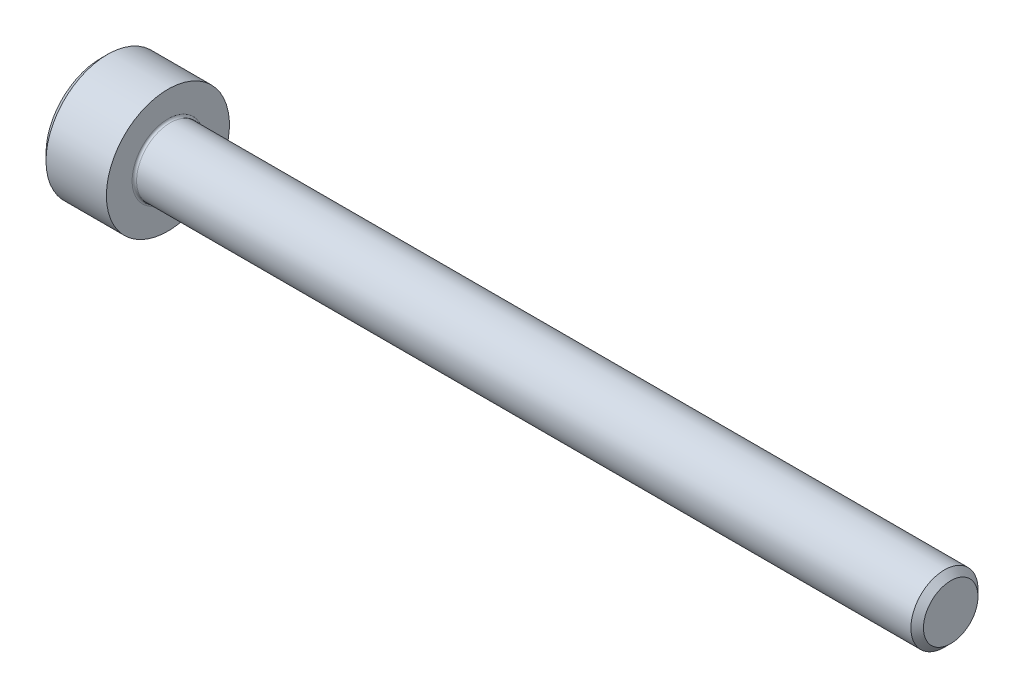
ISO-10303-21;
HEADER;
FILE_DESCRIPTION(('STEP AP214'),'2;1');
FILE_NAME('part.step','',(''),(''),'','','');
FILE_SCHEMA(('AUTOMOTIVE_DESIGN { 1 0 10303 214 1 1 1 1 }'));
ENDSEC;
DATA;
#1=APPLICATION_CONTEXT('core data for automotive mechanical design processes');
#2=APPLICATION_PROTOCOL_DEFINITION('international standard','automotive_design',2000,#1);
#3=PRODUCT_CONTEXT('',#1,'mechanical');
#4=PRODUCT('Part','Part','',(#3));
#5=PRODUCT_RELATED_PRODUCT_CATEGORY('part','',(#4));
#6=PRODUCT_DEFINITION_FORMATION('','',#4);
#7=PRODUCT_DEFINITION_CONTEXT('part definition',#1,'design');
#8=PRODUCT_DEFINITION('design','',#6,#7);
#9=PRODUCT_DEFINITION_SHAPE('','',#8);
#10=(LENGTH_UNIT() NAMED_UNIT(*) SI_UNIT(.MILLI.,.METRE.));
#11=(NAMED_UNIT(*) PLANE_ANGLE_UNIT() SI_UNIT($,.RADIAN.));
#12=(NAMED_UNIT(*) SI_UNIT($,.STERADIAN.) SOLID_ANGLE_UNIT());
#13=UNCERTAINTY_MEASURE_WITH_UNIT(LENGTH_MEASURE(1.E-05),#10,'distance_accuracy_value','');
#14=(GEOMETRIC_REPRESENTATION_CONTEXT(3) GLOBAL_UNCERTAINTY_ASSIGNED_CONTEXT((#13)) GLOBAL_UNIT_ASSIGNED_CONTEXT((#10,
#11,#12)) REPRESENTATION_CONTEXT('',''));
#15=CARTESIAN_POINT('',(0.,0.,0.));
#16=DIRECTION('',(0.,0.,1.));
#17=DIRECTION('',(1.,0.,0.));
#18=AXIS2_PLACEMENT_3D('',#15,#16,#17);
#19=CARTESIAN_POINT('',(0.,0.,0.));
#20=DIRECTION('',(-1.,0.,0.));
#21=DIRECTION('',(0.,0.,1.));
#22=AXIS2_PLACEMENT_3D('',#19,#20,#21);
#23=PLANE('',#22);
#24=DIRECTION('',(0.,-0.5,0.86602540378444));
#25=VECTOR('',#24,1.);
#26=CARTESIAN_POINT('',(0.,1.47801668912544,0.));
#27=LINE('',#26,#25);
#28=CARTESIAN_POINT('',(0.,1.47801668912544,0.));
#29=VERTEX_POINT('',#28);
#30=CARTESIAN_POINT('',(0.,0.739008344562719,1.28));
#31=VERTEX_POINT('',#30);
#32=EDGE_CURVE('E247',#29,#31,#27,.T.);
#33=ORIENTED_EDGE('',*,*,#32,.T.);
#34=DIRECTION('',(0.,1.,0.));
#35=VECTOR('',#34,1.);
#36=CARTESIAN_POINT('',(0.,-0.739008344562723,1.28));
#37=LINE('',#36,#35);
#38=CARTESIAN_POINT('',(0.,-0.739008344562723,1.28));
#39=VERTEX_POINT('',#38);
#40=EDGE_CURVE('E113',#39,#31,#37,.T.);
#41=ORIENTED_EDGE('',*,*,#40,.F.);
#42=DIRECTION('',(0.,-0.5,-0.866025403784438));
#43=VECTOR('',#42,1.);
#44=CARTESIAN_POINT('',(0.,-0.739008344562723,1.28));
#45=LINE('',#44,#43);
#46=CARTESIAN_POINT('',(0.,-1.47801668912545,0.));
#47=VERTEX_POINT('',#46);
#48=EDGE_CURVE('E250',#39,#47,#45,.T.);
#49=ORIENTED_EDGE('',*,*,#48,.T.);
#50=DIRECTION('',(0.,0.5,-0.866025403784439));
#51=VECTOR('',#50,1.);
#52=CARTESIAN_POINT('',(0.,-1.47801668912545,0.));
#53=LINE('',#52,#51);
#54=CARTESIAN_POINT('',(0.,-0.739008344562726,-1.28));
#55=VERTEX_POINT('',#54);
#56=EDGE_CURVE('E253',#47,#55,#53,.T.);
#57=ORIENTED_EDGE('',*,*,#56,.T.);
#58=DIRECTION('',(0.,-1.,0.));
#59=VECTOR('',#58,1.);
#60=CARTESIAN_POINT('',(0.,0.739008344562715,-1.28));
#61=LINE('',#60,#59);
#62=CARTESIAN_POINT('',(0.,0.739008344562715,-1.28));
#63=VERTEX_POINT('',#62);
#64=EDGE_CURVE('E256',#63,#55,#61,.T.);
#65=ORIENTED_EDGE('',*,*,#64,.F.);
#66=DIRECTION('',(0.,-0.5,-0.866025403784438));
#67=VECTOR('',#66,1.);
#68=CARTESIAN_POINT('',(0.,1.47801668912544,0.));
#69=LINE('',#68,#67);
#70=EDGE_CURVE('E108',#29,#63,#69,.T.);
#71=ORIENTED_EDGE('',*,*,#70,.F.);
#72=EDGE_LOOP('',(#33,#41,#49,#57,#65,#71));
#73=FACE_BOUND('',#72,.T.);
#74=CARTESIAN_POINT('',(0.,0.,0.));
#75=DIRECTION('',(-1.,0.,0.));
#76=DIRECTION('',(0.,0.,1.));
#77=AXIS2_PLACEMENT_3D('',#74,#75,#76);
#78=CIRCLE('',#77,2.45);
#79=CARTESIAN_POINT('',(0.,0.,2.45));
#80=VERTEX_POINT('',#79);
#81=EDGE_CURVE('E137',#80,#80,#78,.T.);
#82=ORIENTED_EDGE('',*,*,#81,.T.);
#83=EDGE_LOOP('',(#82));
#84=FACE_BOUND('',#83,.T.);
#85=ADVANCED_FACE('F17',(#73,#84),#23,.T.);
#86=CARTESIAN_POINT('',(0.,0.,0.));
#87=DIRECTION('',(1.,0.,0.));
#88=DIRECTION('',(0.,0.,-1.));
#89=AXIS2_PLACEMENT_3D('',#86,#87,#88);
#90=CONICAL_SURFACE('',#89,2.45,0.785398163397443);
#91=CARTESIAN_POINT('',(0.3,0.,0.));
#92=DIRECTION('',(-1.,0.,0.));
#93=DIRECTION('',(0.,0.,1.));
#94=AXIS2_PLACEMENT_3D('',#91,#92,#93);
#95=CIRCLE('',#94,2.75);
#96=CARTESIAN_POINT('',(0.3,0.,2.75));
#97=VERTEX_POINT('',#96);
#98=EDGE_CURVE('E134',#97,#97,#95,.T.);
#99=ORIENTED_EDGE('',*,*,#98,.T.);
#100=EDGE_LOOP('',(#99));
#101=FACE_BOUND('',#100,.T.);
#102=ORIENTED_EDGE('',*,*,#81,.F.);
#103=EDGE_LOOP('',(#102));
#104=FACE_BOUND('',#103,.T.);
#105=ADVANCED_FACE('F160',(#101,#104),#90,.T.);
#106=CARTESIAN_POINT('',(-31.75,0.,0.));
#107=DIRECTION('',(-1.,0.,0.));
#108=DIRECTION('',(0.,0.,1.));
#109=AXIS2_PLACEMENT_3D('',#106,#107,#108);
#110=CYLINDRICAL_SURFACE('',#109,2.75);
#111=CARTESIAN_POINT('',(3.,0.,0.));
#112=DIRECTION('',(-1.,0.,0.));
#113=DIRECTION('',(0.,0.,1.));
#114=AXIS2_PLACEMENT_3D('',#111,#112,#113);
#115=CIRCLE('',#114,2.75);
#116=CARTESIAN_POINT('',(3.,0.,2.75));
#117=VERTEX_POINT('',#116);
#118=EDGE_CURVE('E131',#117,#117,#115,.T.);
#119=ORIENTED_EDGE('',*,*,#118,.T.);
#120=EDGE_LOOP('',(#119));
#121=FACE_BOUND('',#120,.T.);
#122=ORIENTED_EDGE('',*,*,#98,.F.);
#123=EDGE_LOOP('',(#122));
#124=FACE_BOUND('',#123,.T.);
#125=ADVANCED_FACE('F166',(#121,#124),#110,.T.);
#126=CARTESIAN_POINT('',(3.,2.75,0.));
#127=DIRECTION('',(1.,0.,0.));
#128=DIRECTION('',(0.,0.,-1.));
#129=AXIS2_PLACEMENT_3D('',#126,#127,#128);
#130=PLANE('',#129);
#131=CARTESIAN_POINT('',(3.,0.,0.));
#132=DIRECTION('',(1.,0.,0.));
#133=DIRECTION('',(0.,0.,-1.));
#134=AXIS2_PLACEMENT_3D('',#131,#132,#133);
#135=CIRCLE('',#134,1.6);
#136=CARTESIAN_POINT('',(3.,0.,-1.6));
#137=VERTEX_POINT('',#136);
#138=EDGE_CURVE('E25',#137,#137,#135,.F.);
#139=ORIENTED_EDGE('',*,*,#138,.T.);
#140=EDGE_LOOP('',(#139));
#141=FACE_BOUND('',#140,.T.);
#142=ORIENTED_EDGE('',*,*,#118,.F.);
#143=EDGE_LOOP('',(#142));
#144=FACE_BOUND('',#143,.T.);
#145=ADVANCED_FACE('F142',(#141,#144),#130,.T.);
#146=CARTESIAN_POINT('',(-31.75,0.,0.));
#147=DIRECTION('',(-1.,0.,0.));
#148=DIRECTION('',(0.,0.,1.));
#149=AXIS2_PLACEMENT_3D('',#146,#147,#148);
#150=CYLINDRICAL_SURFACE('',#149,1.5);
#151=CARTESIAN_POINT('',(3.1,0.,0.));
#152=DIRECTION('',(1.,0.,0.));
#153=DIRECTION('',(0.,0.,-1.));
#154=AXIS2_PLACEMENT_3D('',#151,#152,#153);
#155=CIRCLE('',#154,1.5);
#156=CARTESIAN_POINT('',(3.1,0.,-1.5));
#157=VERTEX_POINT('',#156);
#158=EDGE_CURVE('E11',#157,#157,#155,.T.);
#159=ORIENTED_EDGE('',*,*,#158,.T.);
#160=EDGE_LOOP('',(#159));
#161=FACE_BOUND('',#160,.T.);
#162=CARTESIAN_POINT('',(37.7195,0.,0.));
#163=DIRECTION('',(-1.,0.,0.));
#164=DIRECTION('',(0.,0.,1.));
#165=AXIS2_PLACEMENT_3D('',#162,#163,#164);
#166=CIRCLE('',#165,1.5);
#167=CARTESIAN_POINT('',(37.7195,0.,1.5));
#168=VERTEX_POINT('',#167);
#169=EDGE_CURVE('E128',#168,#168,#166,.T.);
#170=ORIENTED_EDGE('',*,*,#169,.T.);
#171=EDGE_LOOP('',(#170));
#172=FACE_BOUND('',#171,.T.);
#173=ADVANCED_FACE('F176',(#161,#172),#150,.T.);
#174=CARTESIAN_POINT('',(38.,0.,0.));
#175=DIRECTION('',(-1.,0.,0.));
#176=DIRECTION('',(0.,0.,1.));
#177=AXIS2_PLACEMENT_3D('',#174,#175,#176);
#178=CONICAL_SURFACE('',#177,1.2195,0.785398163397468);
#179=ORIENTED_EDGE('',*,*,#169,.F.);
#180=EDGE_LOOP('',(#179));
#181=FACE_BOUND('',#180,.T.);
#182=CARTESIAN_POINT('',(38.,0.,0.));
#183=DIRECTION('',(-1.,0.,0.));
#184=DIRECTION('',(0.,0.,1.));
#185=AXIS2_PLACEMENT_3D('',#182,#183,#184);
#186=CIRCLE('',#185,1.2195);
#187=CARTESIAN_POINT('',(38.,0.,1.2195));
#188=VERTEX_POINT('',#187);
#189=EDGE_CURVE('E124',#188,#188,#186,.T.);
#190=ORIENTED_EDGE('',*,*,#189,.T.);
#191=EDGE_LOOP('',(#190));
#192=FACE_BOUND('',#191,.T.);
#193=ADVANCED_FACE('F155',(#181,#192),#178,.T.);
#194=CARTESIAN_POINT('',(38.,1.2195,0.));
#195=DIRECTION('',(1.,0.,0.));
#196=DIRECTION('',(0.,0.,-1.));
#197=AXIS2_PLACEMENT_3D('',#194,#195,#196);
#198=PLANE('',#197);
#199=ORIENTED_EDGE('',*,*,#189,.F.);
#200=EDGE_LOOP('',(#199));
#201=FACE_BOUND('',#200,.T.);
#202=ADVANCED_FACE('F146',(#201),#198,.T.);
#203=CARTESIAN_POINT('',(3.1,0.,0.));
#204=DIRECTION('',(1.,0.,0.));
#205=DIRECTION('',(0.,0.,-1.));
#206=AXIS2_PLACEMENT_3D('',#203,#204,#205);
#207=TOROIDAL_SURFACE('',#206,1.6,0.1);
#208=ORIENTED_EDGE('',*,*,#158,.F.);
#209=EDGE_LOOP('',(#208));
#210=FACE_BOUND('',#209,.T.);
#211=ORIENTED_EDGE('',*,*,#138,.F.);
#212=EDGE_LOOP('',(#211));
#213=FACE_BOUND('',#212,.T.);
#214=ADVANCED_FACE('F19',(#210,#213),#207,.F.);
#215=CARTESIAN_POINT('',(1.3,1.47801668912544,0.));
#216=DIRECTION('',(0.,-0.86602540378444,-0.5));
#217=DIRECTION('',(0.,0.5,-0.86602540378444));
#218=AXIS2_PLACEMENT_3D('',#215,#216,#217);
#219=PLANE('',#218);
#220=ORIENTED_EDGE('',*,*,#32,.F.);
#221=DIRECTION('',(-1.,0.,0.));
#222=VECTOR('',#221,1.);
#223=CARTESIAN_POINT('',(1.3,1.47801668912544,0.));
#224=LINE('',#223,#222);
#225=CARTESIAN_POINT('',(1.3,1.47801668912544,0.));
#226=VERTEX_POINT('',#225);
#227=EDGE_CURVE('E237',#226,#29,#224,.T.);
#228=ORIENTED_EDGE('',*,*,#227,.F.);
#229=DIRECTION('',(0.,-0.5,0.86602540378444));
#230=VECTOR('',#229,1.);
#231=CARTESIAN_POINT('',(1.3,1.47801668912544,0.));
#232=LINE('',#231,#230);
#233=CARTESIAN_POINT('',(1.3,1.10851251684408,0.64));
#234=VERTEX_POINT('',#233);
#235=EDGE_CURVE('E100',#226,#234,#232,.T.);
#236=ORIENTED_EDGE('',*,*,#235,.T.);
#237=CARTESIAN_POINT('',(1.3,0.739008344562719,1.28));
#238=VERTEX_POINT('',#237);
#239=EDGE_CURVE('E91',#234,#238,#232,.T.);
#240=ORIENTED_EDGE('',*,*,#239,.T.);
#241=DIRECTION('',(-1.,0.,0.));
#242=VECTOR('',#241,1.);
#243=CARTESIAN_POINT('',(1.3,0.739008344562719,1.28));
#244=LINE('',#243,#242);
#245=EDGE_CURVE('E105',#238,#31,#244,.T.);
#246=ORIENTED_EDGE('',*,*,#245,.T.);
#247=EDGE_LOOP('',(#220,#228,#236,#240,#246));
#248=FACE_BOUND('',#247,.T.);
#249=ADVANCED_FACE('F104',(#248),#219,.T.);
#250=CARTESIAN_POINT('',(1.3,-0.739008344562723,1.28));
#251=DIRECTION('',(0.,0.,1.));
#252=DIRECTION('',(0.,-1.,0.));
#253=AXIS2_PLACEMENT_3D('',#250,#251,#252);
#254=PLANE('',#253);
#255=ORIENTED_EDGE('',*,*,#40,.T.);
#256=ORIENTED_EDGE('',*,*,#245,.F.);
#257=DIRECTION('',(0.,1.,0.));
#258=VECTOR('',#257,1.);
#259=CARTESIAN_POINT('',(1.3,-0.739008344562723,1.28));
#260=LINE('',#259,#258);
#261=CARTESIAN_POINT('',(1.3,0.,1.28));
#262=VERTEX_POINT('',#261);
#263=EDGE_CURVE('E88',#262,#238,#260,.T.);
#264=ORIENTED_EDGE('',*,*,#263,.F.);
#265=CARTESIAN_POINT('',(1.3,-0.739008344562723,1.28));
#266=VERTEX_POINT('',#265);
#267=EDGE_CURVE('E99',#266,#262,#260,.T.);
#268=ORIENTED_EDGE('',*,*,#267,.F.);
#269=DIRECTION('',(-1.,0.,0.));
#270=VECTOR('',#269,1.);
#271=CARTESIAN_POINT('',(1.3,-0.739008344562723,1.28));
#272=LINE('',#271,#270);
#273=EDGE_CURVE('E115',#266,#39,#272,.T.);
#274=ORIENTED_EDGE('',*,*,#273,.T.);
#275=EDGE_LOOP('',(#255,#256,#264,#268,#274));
#276=FACE_BOUND('',#275,.T.);
#277=ADVANCED_FACE('F110',(#276),#254,.F.);
#278=CARTESIAN_POINT('',(1.3,-0.739008344562723,1.28));
#279=DIRECTION('',(0.,0.866025403784438,-0.5));
#280=DIRECTION('',(0.,0.5,0.866025403784438));
#281=AXIS2_PLACEMENT_3D('',#278,#279,#280);
#282=PLANE('',#281);
#283=ORIENTED_EDGE('',*,*,#48,.F.);
#284=ORIENTED_EDGE('',*,*,#273,.F.);
#285=DIRECTION('',(0.,-0.5,-0.866025403784438));
#286=VECTOR('',#285,1.);
#287=CARTESIAN_POINT('',(1.3,-0.739008344562723,1.28));
#288=LINE('',#287,#286);
#289=CARTESIAN_POINT('',(1.3,-1.10851251684408,0.64));
#290=VERTEX_POINT('',#289);
#291=EDGE_CURVE('E276',#266,#290,#288,.T.);
#292=ORIENTED_EDGE('',*,*,#291,.T.);
#293=CARTESIAN_POINT('',(1.3,-1.47801668912545,0.));
#294=VERTEX_POINT('',#293);
#295=EDGE_CURVE('E265',#290,#294,#288,.T.);
#296=ORIENTED_EDGE('',*,*,#295,.T.);
#297=DIRECTION('',(-1.,0.,0.));
#298=VECTOR('',#297,1.);
#299=CARTESIAN_POINT('',(1.3,-1.47801668912545,0.));
#300=LINE('',#299,#298);
#301=EDGE_CURVE('E120',#294,#47,#300,.T.);
#302=ORIENTED_EDGE('',*,*,#301,.T.);
#303=EDGE_LOOP('',(#283,#284,#292,#296,#302));
#304=FACE_BOUND('',#303,.T.);
#305=ADVANCED_FACE('F189',(#304),#282,.T.);
#306=CARTESIAN_POINT('',(1.3,-1.47801668912545,0.));
#307=DIRECTION('',(0.,0.86602540378444,0.5));
#308=DIRECTION('',(0.,-0.5,0.86602540378444));
#309=AXIS2_PLACEMENT_3D('',#306,#307,#308);
#310=PLANE('',#309);
#311=ORIENTED_EDGE('',*,*,#56,.F.);
#312=ORIENTED_EDGE('',*,*,#301,.F.);
#313=DIRECTION('',(0.,0.5,-0.866025403784439));
#314=VECTOR('',#313,1.);
#315=CARTESIAN_POINT('',(1.3,-1.47801668912545,0.));
#316=LINE('',#315,#314);
#317=CARTESIAN_POINT('',(1.3,-1.10851251684409,-0.64));
#318=VERTEX_POINT('',#317);
#319=EDGE_CURVE('E243',#294,#318,#316,.T.);
#320=ORIENTED_EDGE('',*,*,#319,.T.);
#321=CARTESIAN_POINT('',(1.3,-0.739008344562726,-1.28));
#322=VERTEX_POINT('',#321);
#323=EDGE_CURVE('E275',#318,#322,#316,.T.);
#324=ORIENTED_EDGE('',*,*,#323,.T.);
#325=DIRECTION('',(-1.,0.,0.));
#326=VECTOR('',#325,1.);
#327=CARTESIAN_POINT('',(1.3,-0.739008344562726,-1.28));
#328=LINE('',#327,#326);
#329=EDGE_CURVE('E236',#322,#55,#328,.T.);
#330=ORIENTED_EDGE('',*,*,#329,.T.);
#331=EDGE_LOOP('',(#311,#312,#320,#324,#330));
#332=FACE_BOUND('',#331,.T.);
#333=ADVANCED_FACE('F192',(#332),#310,.T.);
#334=CARTESIAN_POINT('',(1.3,0.739008344562715,-1.28));
#335=DIRECTION('',(0.,0.,-1.));
#336=DIRECTION('',(0.,1.,0.));
#337=AXIS2_PLACEMENT_3D('',#334,#335,#336);
#338=PLANE('',#337);
#339=ORIENTED_EDGE('',*,*,#64,.T.);
#340=ORIENTED_EDGE('',*,*,#329,.F.);
#341=DIRECTION('',(0.,-1.,0.));
#342=VECTOR('',#341,1.);
#343=CARTESIAN_POINT('',(1.3,0.739008344562715,-1.28));
#344=LINE('',#343,#342);
#345=CARTESIAN_POINT('',(1.3,0.,-1.28));
#346=VERTEX_POINT('',#345);
#347=EDGE_CURVE('E240',#346,#322,#344,.T.);
#348=ORIENTED_EDGE('',*,*,#347,.F.);
#349=CARTESIAN_POINT('',(1.3,0.739008344562715,-1.28));
#350=VERTEX_POINT('',#349);
#351=EDGE_CURVE('E32',#350,#346,#344,.T.);
#352=ORIENTED_EDGE('',*,*,#351,.F.);
#353=DIRECTION('',(-1.,0.,0.));
#354=VECTOR('',#353,1.);
#355=CARTESIAN_POINT('',(1.3,0.739008344562715,-1.28));
#356=LINE('',#355,#354);
#357=EDGE_CURVE('E233',#350,#63,#356,.T.);
#358=ORIENTED_EDGE('',*,*,#357,.T.);
#359=EDGE_LOOP('',(#339,#340,#348,#352,#358));
#360=FACE_BOUND('',#359,.T.);
#361=ADVANCED_FACE('F196',(#360),#338,.F.);
#362=CARTESIAN_POINT('',(1.3,1.47801668912544,0.));
#363=DIRECTION('',(0.,0.866025403784438,-0.5));
#364=DIRECTION('',(0.,0.5,0.866025403784438));
#365=AXIS2_PLACEMENT_3D('',#362,#363,#364);
#366=PLANE('',#365);
#367=ORIENTED_EDGE('',*,*,#70,.T.);
#368=ORIENTED_EDGE('',*,*,#357,.F.);
#369=DIRECTION('',(0.,-0.5,-0.866025403784438));
#370=VECTOR('',#369,1.);
#371=CARTESIAN_POINT('',(1.3,1.47801668912544,0.));
#372=LINE('',#371,#370);
#373=CARTESIAN_POINT('',(1.3,1.10851251684408,-0.64));
#374=VERTEX_POINT('',#373);
#375=EDGE_CURVE('E223',#374,#350,#372,.T.);
#376=ORIENTED_EDGE('',*,*,#375,.F.);
#377=EDGE_CURVE('E229',#226,#374,#372,.T.);
#378=ORIENTED_EDGE('',*,*,#377,.F.);
#379=ORIENTED_EDGE('',*,*,#227,.T.);
#380=EDGE_LOOP('',(#367,#368,#376,#378,#379));
#381=FACE_BOUND('',#380,.T.);
#382=ADVANCED_FACE('F200',(#381),#366,.F.);
#383=CARTESIAN_POINT('',(1.3,2.21702503368815,-1.28));
#384=DIRECTION('',(1.,0.,0.));
#385=DIRECTION('',(0.,0.,-1.));
#386=AXIS2_PLACEMENT_3D('',#383,#384,#385);
#387=PLANE('',#386);
#388=ORIENTED_EDGE('',*,*,#347,.T.);
#389=ORIENTED_EDGE('',*,*,#323,.F.);
#390=CARTESIAN_POINT('',(1.3,0.,0.));
#391=DIRECTION('',(-1.,0.,0.));
#392=DIRECTION('',(0.,0.,1.));
#393=AXIS2_PLACEMENT_3D('',#390,#391,#392);
#394=CIRCLE('',#393,1.28);
#395=EDGE_CURVE('E271',#346,#318,#394,.T.);
#396=ORIENTED_EDGE('',*,*,#395,.F.);
#397=EDGE_LOOP('',(#388,#389,#396));
#398=FACE_BOUND('',#397,.T.);
#399=ADVANCED_FACE('F204',(#398),#387,.F.);
#400=ORIENTED_EDGE('',*,*,#319,.F.);
#401=ORIENTED_EDGE('',*,*,#295,.F.);
#402=EDGE_CURVE('E118',#318,#290,#394,.T.);
#403=ORIENTED_EDGE('',*,*,#402,.F.);
#404=EDGE_LOOP('',(#400,#401,#403));
#405=FACE_BOUND('',#404,.T.);
#406=ADVANCED_FACE('F207',(#405),#387,.F.);
#407=ORIENTED_EDGE('',*,*,#291,.F.);
#408=ORIENTED_EDGE('',*,*,#267,.T.);
#409=EDGE_CURVE('E114',#290,#262,#394,.T.);
#410=ORIENTED_EDGE('',*,*,#409,.F.);
#411=EDGE_LOOP('',(#407,#408,#410));
#412=FACE_BOUND('',#411,.T.);
#413=ADVANCED_FACE('F213',(#412),#387,.F.);
#414=ORIENTED_EDGE('',*,*,#263,.T.);
#415=ORIENTED_EDGE('',*,*,#239,.F.);
#416=EDGE_CURVE('E94',#262,#234,#394,.T.);
#417=ORIENTED_EDGE('',*,*,#416,.F.);
#418=EDGE_LOOP('',(#414,#415,#417));
#419=FACE_BOUND('',#418,.T.);
#420=ADVANCED_FACE('F90',(#419),#387,.F.);
#421=ORIENTED_EDGE('',*,*,#235,.F.);
#422=ORIENTED_EDGE('',*,*,#377,.T.);
#423=EDGE_CURVE('E125',#234,#374,#394,.T.);
#424=ORIENTED_EDGE('',*,*,#423,.F.);
#425=EDGE_LOOP('',(#421,#422,#424));
#426=FACE_BOUND('',#425,.T.);
#427=ADVANCED_FACE('F216',(#426),#387,.F.);
#428=ORIENTED_EDGE('',*,*,#375,.T.);
#429=ORIENTED_EDGE('',*,*,#351,.T.);
#430=EDGE_CURVE('E226',#374,#346,#394,.T.);
#431=ORIENTED_EDGE('',*,*,#430,.F.);
#432=EDGE_LOOP('',(#428,#429,#431));
#433=FACE_BOUND('',#432,.T.);
#434=ADVANCED_FACE('F185',(#433),#387,.F.);
#435=CARTESIAN_POINT('',(1.3,0.,0.));
#436=DIRECTION('',(-1.,0.,0.));
#437=DIRECTION('',(0.,0.,1.));
#438=AXIS2_PLACEMENT_3D('',#435,#436,#437);
#439=CONICAL_SURFACE('',#438,1.28,1.0471975511966);
#440=CARTESIAN_POINT('',(2.03900834456273,0.,0.));
#441=VERTEX_POINT('',#440);
#442=VERTEX_LOOP('',#441);
#443=FACE_BOUND('',#442,.T.);
#444=ORIENTED_EDGE('',*,*,#416,.T.);
#445=ORIENTED_EDGE('',*,*,#423,.T.);
#446=ORIENTED_EDGE('',*,*,#430,.T.);
#447=ORIENTED_EDGE('',*,*,#395,.T.);
#448=ORIENTED_EDGE('',*,*,#402,.T.);
#449=ORIENTED_EDGE('',*,*,#409,.T.);
#450=EDGE_LOOP('',(#444,#445,#446,#447,#448,#449));
#451=FACE_BOUND('',#450,.T.);
#452=ADVANCED_FACE('F183',(#443,#451),#439,.F.);
#453=CLOSED_SHELL('',(#85,#105,#125,#145,#173,#193,#202,#214,#249,#277,#305,#333,#361,#382,#399,
#406,#413,#420,#427,#434,#452));
#454=MANIFOLD_SOLID_BREP('B1',#453);
#455=ADVANCED_BREP_SHAPE_REPRESENTATION('',(#18,#454),#14);
#456=SHAPE_DEFINITION_REPRESENTATION(#9,#455);
ENDSEC;
END-ISO-10303-21;
